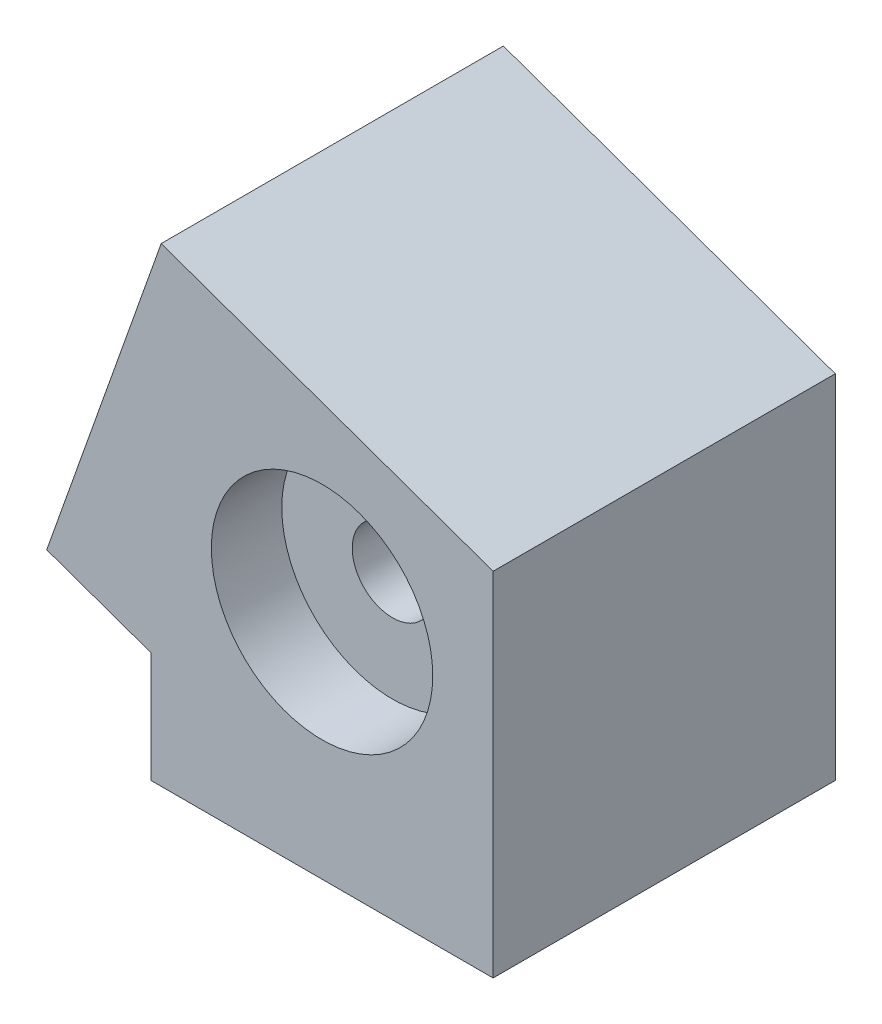
ISO-10303-21;
HEADER;
FILE_DESCRIPTION(('STEP AP214'),'2;1');
FILE_NAME('part.step','',(''),(''),'','','');
FILE_SCHEMA(('AUTOMOTIVE_DESIGN { 1 0 10303 214 1 1 1 1 }'));
ENDSEC;
DATA;
#1=APPLICATION_CONTEXT('core data for automotive mechanical design processes');
#2=APPLICATION_PROTOCOL_DEFINITION('international standard','automotive_design',2000,#1);
#3=PRODUCT_CONTEXT('',#1,'mechanical');
#4=PRODUCT('Part','Part','',(#3));
#5=PRODUCT_RELATED_PRODUCT_CATEGORY('part','',(#4));
#6=PRODUCT_DEFINITION_FORMATION('','',#4);
#7=PRODUCT_DEFINITION_CONTEXT('part definition',#1,'design');
#8=PRODUCT_DEFINITION('design','',#6,#7);
#9=PRODUCT_DEFINITION_SHAPE('','',#8);
#10=(LENGTH_UNIT() NAMED_UNIT(*) SI_UNIT(.MILLI.,.METRE.));
#11=(NAMED_UNIT(*) PLANE_ANGLE_UNIT() SI_UNIT($,.RADIAN.));
#12=(NAMED_UNIT(*) SI_UNIT($,.STERADIAN.) SOLID_ANGLE_UNIT());
#13=UNCERTAINTY_MEASURE_WITH_UNIT(LENGTH_MEASURE(1.E-05),#10,'distance_accuracy_value','');
#14=(GEOMETRIC_REPRESENTATION_CONTEXT(3) GLOBAL_UNCERTAINTY_ASSIGNED_CONTEXT((#13)) GLOBAL_UNIT_ASSIGNED_CONTEXT((#10,
#11,#12)) REPRESENTATION_CONTEXT('',''));
#15=CARTESIAN_POINT('',(0.,0.,0.));
#16=DIRECTION('',(0.,0.,1.));
#17=DIRECTION('',(1.,0.,0.));
#18=AXIS2_PLACEMENT_3D('',#15,#16,#17);
#19=CARTESIAN_POINT('',(-21.6706671951878,30.6896057397236,0.));
#20=DIRECTION('',(-0.942371237949982,0.33456905099638,0.));
#21=DIRECTION('',(0.,0.,-1.));
#22=AXIS2_PLACEMENT_3D('',#19,#20,#21);
#23=PLANE('',#22);
#24=DIRECTION('',(0.,0.,-1.));
#25=VECTOR('',#24,1.);
#26=CARTESIAN_POINT('',(-15.9829933282494,46.7099167848733,17.));
#27=LINE('',#26,#25);
#28=CARTESIAN_POINT('',(-15.9829933282494,46.7099167848733,17.));
#29=VERTEX_POINT('',#28);
#30=CARTESIAN_POINT('',(-15.9829933282494,46.7099167848733,-17.));
#31=VERTEX_POINT('',#30);
#32=EDGE_CURVE('E197',#29,#31,#27,.T.);
#33=ORIENTED_EDGE('',*,*,#32,.T.);
#34=DIRECTION('',(-0.334569050996379,-0.942371237949982,0.));
#35=VECTOR('',#34,1.);
#36=CARTESIAN_POINT('',(-27.3583410621263,14.6692946945739,-17.));
#37=LINE('',#36,#35);
#38=CARTESIAN_POINT('',(-27.3583410621263,14.6692946945739,-17.));
#39=VERTEX_POINT('',#38);
#40=EDGE_CURVE('E214',#31,#39,#37,.T.);
#41=ORIENTED_EDGE('',*,*,#40,.T.);
#42=DIRECTION('',(0.,0.,1.));
#43=VECTOR('',#42,1.);
#44=CARTESIAN_POINT('',(-27.3583410621263,14.6692946945739,17.));
#45=LINE('',#44,#43);
#46=CARTESIAN_POINT('',(-27.3583410621263,14.6692946945739,17.));
#47=VERTEX_POINT('',#46);
#48=EDGE_CURVE('E210',#39,#47,#45,.T.);
#49=ORIENTED_EDGE('',*,*,#48,.T.);
#50=DIRECTION('',(0.334569050996379,0.942371237949982,0.));
#51=VECTOR('',#50,1.);
#52=CARTESIAN_POINT('',(-27.3583410621263,14.6692946945739,17.));
#53=LINE('',#52,#51);
#54=EDGE_CURVE('E206',#47,#29,#53,.T.);
#55=ORIENTED_EDGE('',*,*,#54,.T.);
#56=EDGE_LOOP('',(#33,#41,#49,#55));
#57=FACE_BOUND('',#56,.T.);
#58=DIRECTION('',(0.334569050996379,0.942371237949982,0.));
#59=VECTOR('',#58,1.);
#60=CARTESIAN_POINT('',(-26.6892029601335,16.5540371704739,-15.));
#61=LINE('',#60,#59);
#62=CARTESIAN_POINT('',(-26.6892029601335,16.5540371704739,-15.));
#63=VERTEX_POINT('',#62);
#64=CARTESIAN_POINT('',(-16.6521314302421,44.8251743089733,-15.));
#65=VERTEX_POINT('',#64);
#66=EDGE_CURVE('E187',#63,#65,#61,.T.);
#67=ORIENTED_EDGE('',*,*,#66,.T.);
#68=DIRECTION('',(0.,0.,1.));
#69=VECTOR('',#68,1.);
#70=CARTESIAN_POINT('',(-16.6521314302422,44.8251743089733,-15.));
#71=LINE('',#70,#69);
#72=CARTESIAN_POINT('',(-16.6521314302422,44.8251743089733,15.));
#73=VERTEX_POINT('',#72);
#74=EDGE_CURVE('E62',#65,#73,#71,.T.);
#75=ORIENTED_EDGE('',*,*,#74,.T.);
#76=DIRECTION('',(-0.334569050996379,-0.942371237949982,0.));
#77=VECTOR('',#76,1.);
#78=CARTESIAN_POINT('',(-26.6892029601335,16.5540371704739,15.));
#79=LINE('',#78,#77);
#80=CARTESIAN_POINT('',(-26.6892029601335,16.5540371704739,15.));
#81=VERTEX_POINT('',#80);
#82=EDGE_CURVE('E171',#73,#81,#79,.T.);
#83=ORIENTED_EDGE('',*,*,#82,.T.);
#84=DIRECTION('',(0.,0.,-1.));
#85=VECTOR('',#84,1.);
#86=CARTESIAN_POINT('',(-26.6892029601335,16.5540371704739,-15.));
#87=LINE('',#86,#85);
#88=EDGE_CURVE('E175',#81,#63,#87,.T.);
#89=ORIENTED_EDGE('',*,*,#88,.T.);
#90=EDGE_LOOP('',(#67,#75,#83,#89));
#91=FACE_BOUND('',#90,.T.);
#92=ADVANCED_FACE('F45',(#57,#91),#23,.T.);
#93=CARTESIAN_POINT('',(17.,35.,17.));
#94=DIRECTION('',(-1.,0.,0.));
#95=DIRECTION('',(0.,0.,1.));
#96=AXIS2_PLACEMENT_3D('',#93,#94,#95);
#97=PLANE('',#96);
#98=DIRECTION('',(0.,0.,-1.));
#99=VECTOR('',#98,1.);
#100=CARTESIAN_POINT('',(17.,0.,17.));
#101=LINE('',#100,#99);
#102=CARTESIAN_POINT('',(17.,0.,17.));
#103=VERTEX_POINT('',#102);
#104=CARTESIAN_POINT('',(17.,0.,-17.));
#105=VERTEX_POINT('',#104);
#106=EDGE_CURVE('E274',#103,#105,#101,.T.);
#107=ORIENTED_EDGE('',*,*,#106,.T.);
#108=DIRECTION('',(0.,-1.,0.));
#109=VECTOR('',#108,1.);
#110=CARTESIAN_POINT('',(17.,35.,-17.));
#111=LINE('',#110,#109);
#112=CARTESIAN_POINT('',(17.,35.,-17.));
#113=VERTEX_POINT('',#112);
#114=EDGE_CURVE('E11',#113,#105,#111,.T.);
#115=ORIENTED_EDGE('',*,*,#114,.F.);
#116=DIRECTION('',(0.,0.,-1.));
#117=VECTOR('',#116,1.);
#118=CARTESIAN_POINT('',(17.,35.,17.));
#119=LINE('',#118,#117);
#120=CARTESIAN_POINT('',(17.,35.,17.));
#121=VERTEX_POINT('',#120);
#122=EDGE_CURVE('E275',#121,#113,#119,.T.);
#123=ORIENTED_EDGE('',*,*,#122,.F.);
#124=DIRECTION('',(0.,-1.,0.));
#125=VECTOR('',#124,1.);
#126=CARTESIAN_POINT('',(17.,35.,17.));
#127=LINE('',#126,#125);
#128=EDGE_CURVE('E279',#121,#103,#127,.T.);
#129=ORIENTED_EDGE('',*,*,#128,.T.);
#130=EDGE_LOOP('',(#107,#115,#123,#129));
#131=FACE_BOUND('',#130,.T.);
#132=ADVANCED_FACE('F47',(#131),#97,.F.);
#133=CARTESIAN_POINT('',(-17.,35.,-17.));
#134=DIRECTION('',(0.,0.,1.));
#135=DIRECTION('',(1.,0.,0.));
#136=AXIS2_PLACEMENT_3D('',#133,#134,#135);
#137=PLANE('',#136);
#138=CARTESIAN_POINT('',(0.,22.9958919823676,-17.));
#139=DIRECTION('',(0.,0.,-1.));
#140=DIRECTION('',(-1.,0.,0.));
#141=AXIS2_PLACEMENT_3D('',#138,#139,#140);
#142=CIRCLE('',#141,11.);
#143=CARTESIAN_POINT('',(-11.,22.9958919823676,-17.));
#144=VERTEX_POINT('',#143);
#145=EDGE_CURVE('E178',#144,#144,#142,.T.);
#146=ORIENTED_EDGE('',*,*,#145,.F.);
#147=EDGE_LOOP('',(#146));
#148=FACE_BOUND('',#147,.T.);
#149=DIRECTION('',(0.,-1.,0.));
#150=VECTOR('',#149,1.);
#151=CARTESIAN_POINT('',(-17.,35.,-17.));
#152=LINE('',#151,#150);
#153=CARTESIAN_POINT('',(-17.,10.9917839647352,-17.));
#154=VERTEX_POINT('',#153);
#155=CARTESIAN_POINT('',(-17.,0.,-17.));
#156=VERTEX_POINT('',#155);
#157=EDGE_CURVE('E55',#154,#156,#152,.T.);
#158=ORIENTED_EDGE('',*,*,#157,.F.);
#159=DIRECTION('',(-0.942371237949982,0.33456905099638,0.));
#160=VECTOR('',#159,1.);
#161=CARTESIAN_POINT('',(5.62465226612309,2.9593779097006,-17.));
#162=LINE('',#161,#160);
#163=EDGE_CURVE('E221',#154,#39,#162,.T.);
#164=ORIENTED_EDGE('',*,*,#163,.T.);
#165=ORIENTED_EDGE('',*,*,#40,.F.);
#166=DIRECTION('',(-0.942371237949982,0.33456905099638,0.));
#167=VECTOR('',#166,1.);
#168=CARTESIAN_POINT('',(17.,35.,-17.));
#169=LINE('',#168,#167);
#170=EDGE_CURVE('E218',#113,#31,#169,.T.);
#171=ORIENTED_EDGE('',*,*,#170,.F.);
#172=ORIENTED_EDGE('',*,*,#114,.T.);
#173=DIRECTION('',(-1.,0.,0.));
#174=VECTOR('',#173,1.);
#175=CARTESIAN_POINT('',(-17.,0.,-17.));
#176=LINE('',#175,#174);
#177=EDGE_CURVE('E284',#105,#156,#176,.T.);
#178=ORIENTED_EDGE('',*,*,#177,.T.);
#179=EDGE_LOOP('',(#158,#164,#165,#171,#172,#178));
#180=FACE_BOUND('',#179,.T.);
#181=ADVANCED_FACE('F308',(#148,#180),#137,.F.);
#182=CARTESIAN_POINT('',(-17.,35.,17.));
#183=DIRECTION('',(1.,0.,0.));
#184=DIRECTION('',(0.,0.,-1.));
#185=AXIS2_PLACEMENT_3D('',#182,#183,#184);
#186=PLANE('',#185);
#187=DIRECTION('',(0.,-1.,0.));
#188=VECTOR('',#187,1.);
#189=CARTESIAN_POINT('',(-17.,35.,17.));
#190=LINE('',#189,#188);
#191=CARTESIAN_POINT('',(-17.,10.9917839647352,17.));
#192=VERTEX_POINT('',#191);
#193=CARTESIAN_POINT('',(-17.,0.,17.));
#194=VERTEX_POINT('',#193);
#195=EDGE_CURVE('E297',#192,#194,#190,.T.);
#196=ORIENTED_EDGE('',*,*,#195,.F.);
#197=DIRECTION('',(0.,0.,1.));
#198=VECTOR('',#197,1.);
#199=CARTESIAN_POINT('',(-17.,10.9917839647352,-18.));
#200=LINE('',#199,#198);
#201=EDGE_CURVE('E262',#154,#192,#200,.T.);
#202=ORIENTED_EDGE('',*,*,#201,.F.);
#203=ORIENTED_EDGE('',*,*,#157,.T.);
#204=DIRECTION('',(0.,0.,1.));
#205=VECTOR('',#204,1.);
#206=CARTESIAN_POINT('',(-17.,0.,17.));
#207=LINE('',#206,#205);
#208=EDGE_CURVE('E288',#156,#194,#207,.T.);
#209=ORIENTED_EDGE('',*,*,#208,.T.);
#210=EDGE_LOOP('',(#196,#202,#203,#209));
#211=FACE_BOUND('',#210,.T.);
#212=ADVANCED_FACE('F303',(#211),#186,.F.);
#213=CARTESIAN_POINT('',(-17.,35.,17.));
#214=DIRECTION('',(0.,0.,-1.));
#215=DIRECTION('',(-1.,0.,0.));
#216=AXIS2_PLACEMENT_3D('',#213,#214,#215);
#217=PLANE('',#216);
#218=CARTESIAN_POINT('',(0.,22.9958919823676,17.));
#219=DIRECTION('',(0.,0.,1.));
#220=DIRECTION('',(1.,0.,0.));
#221=AXIS2_PLACEMENT_3D('',#218,#219,#220);
#222=CIRCLE('',#221,11.);
#223=CARTESIAN_POINT('',(11.,22.9958919823676,17.));
#224=VERTEX_POINT('',#223);
#225=EDGE_CURVE('E392',#224,#224,#222,.T.);
#226=ORIENTED_EDGE('',*,*,#225,.F.);
#227=EDGE_LOOP('',(#226));
#228=FACE_BOUND('',#227,.T.);
#229=DIRECTION('',(-0.942371237949982,0.33456905099638,0.));
#230=VECTOR('',#229,1.);
#231=CARTESIAN_POINT('',(5.62465226612309,2.9593779097006,17.));
#232=LINE('',#231,#230);
#233=EDGE_CURVE('E224',#192,#47,#232,.T.);
#234=ORIENTED_EDGE('',*,*,#233,.F.);
#235=ORIENTED_EDGE('',*,*,#195,.T.);
#236=DIRECTION('',(1.,0.,0.));
#237=VECTOR('',#236,1.);
#238=CARTESIAN_POINT('',(-17.,0.,17.));
#239=LINE('',#238,#237);
#240=EDGE_CURVE('E280',#194,#103,#239,.T.);
#241=ORIENTED_EDGE('',*,*,#240,.T.);
#242=ORIENTED_EDGE('',*,*,#128,.F.);
#243=DIRECTION('',(-0.942371237949982,0.33456905099638,0.));
#244=VECTOR('',#243,1.);
#245=CARTESIAN_POINT('',(17.,35.,17.));
#246=LINE('',#245,#244);
#247=EDGE_CURVE('E227',#121,#29,#246,.T.);
#248=ORIENTED_EDGE('',*,*,#247,.T.);
#249=ORIENTED_EDGE('',*,*,#54,.F.);
#250=EDGE_LOOP('',(#234,#235,#241,#242,#248,#249));
#251=FACE_BOUND('',#250,.T.);
#252=ADVANCED_FACE('F315',(#228,#251),#217,.F.);
#253=CARTESIAN_POINT('',(0.,0.,0.));
#254=DIRECTION('',(0.,-1.,0.));
#255=DIRECTION('',(0.,0.,-1.));
#256=AXIS2_PLACEMENT_3D('',#253,#254,#255);
#257=PLANE('',#256);
#258=DIRECTION('',(0.,0.,1.));
#259=VECTOR('',#258,1.);
#260=CARTESIAN_POINT('',(15.,0.,-15.));
#261=LINE('',#260,#259);
#262=CARTESIAN_POINT('',(15.,0.,-15.));
#263=VERTEX_POINT('',#262);
#264=CARTESIAN_POINT('',(15.,0.,15.));
#265=VERTEX_POINT('',#264);
#266=EDGE_CURVE('E70',#263,#265,#261,.T.);
#267=ORIENTED_EDGE('',*,*,#266,.F.);
#268=DIRECTION('',(1.,0.,0.));
#269=VECTOR('',#268,1.);
#270=CARTESIAN_POINT('',(-15.,0.,-15.));
#271=LINE('',#270,#269);
#272=CARTESIAN_POINT('',(-15.,0.,-15.));
#273=VERTEX_POINT('',#272);
#274=EDGE_CURVE('E235',#273,#263,#271,.T.);
#275=ORIENTED_EDGE('',*,*,#274,.F.);
#276=DIRECTION('',(0.,0.,-1.));
#277=VECTOR('',#276,1.);
#278=CARTESIAN_POINT('',(-15.,0.,-15.));
#279=LINE('',#278,#277);
#280=CARTESIAN_POINT('',(-15.,0.,15.));
#281=VERTEX_POINT('',#280);
#282=EDGE_CURVE('E252',#281,#273,#279,.T.);
#283=ORIENTED_EDGE('',*,*,#282,.F.);
#284=DIRECTION('',(-1.,0.,0.));
#285=VECTOR('',#284,1.);
#286=CARTESIAN_POINT('',(-15.,0.,15.));
#287=LINE('',#286,#285);
#288=EDGE_CURVE('E248',#265,#281,#287,.T.);
#289=ORIENTED_EDGE('',*,*,#288,.F.);
#290=EDGE_LOOP('',(#267,#275,#283,#289));
#291=FACE_BOUND('',#290,.T.);
#292=ORIENTED_EDGE('',*,*,#106,.F.);
#293=ORIENTED_EDGE('',*,*,#240,.F.);
#294=ORIENTED_EDGE('',*,*,#208,.F.);
#295=ORIENTED_EDGE('',*,*,#177,.F.);
#296=EDGE_LOOP('',(#292,#293,#294,#295));
#297=FACE_BOUND('',#296,.T.);
#298=ADVANCED_FACE('F312',(#291,#297),#257,.T.);
#299=CARTESIAN_POINT('',(15.,10.,-15.));
#300=DIRECTION('',(1.,0.,0.));
#301=DIRECTION('',(0.,0.,-1.));
#302=AXIS2_PLACEMENT_3D('',#299,#300,#301);
#303=PLANE('',#302);
#304=ORIENTED_EDGE('',*,*,#266,.T.);
#305=DIRECTION('',(0.,-1.,0.));
#306=VECTOR('',#305,1.);
#307=CARTESIAN_POINT('',(15.,10.,15.));
#308=LINE('',#307,#306);
#309=CARTESIAN_POINT('',(15.,10.,15.));
#310=VERTEX_POINT('',#309);
#311=EDGE_CURVE('E245',#310,#265,#308,.T.);
#312=ORIENTED_EDGE('',*,*,#311,.F.);
#313=DIRECTION('',(0.,0.,1.));
#314=VECTOR('',#313,1.);
#315=CARTESIAN_POINT('',(15.,10.,-15.));
#316=LINE('',#315,#314);
#317=CARTESIAN_POINT('',(15.,10.,-15.));
#318=VERTEX_POINT('',#317);
#319=EDGE_CURVE('E230',#318,#310,#316,.T.);
#320=ORIENTED_EDGE('',*,*,#319,.F.);
#321=DIRECTION('',(0.,-1.,0.));
#322=VECTOR('',#321,1.);
#323=CARTESIAN_POINT('',(15.,10.,-15.));
#324=LINE('',#323,#322);
#325=EDGE_CURVE('E259',#318,#263,#324,.T.);
#326=ORIENTED_EDGE('',*,*,#325,.T.);
#327=EDGE_LOOP('',(#304,#312,#320,#326));
#328=FACE_BOUND('',#327,.T.);
#329=ADVANCED_FACE('F419',(#328),#303,.F.);
#330=CARTESIAN_POINT('',(-15.,10.,-15.));
#331=DIRECTION('',(0.,0.,-1.));
#332=DIRECTION('',(-1.,0.,0.));
#333=AXIS2_PLACEMENT_3D('',#330,#331,#332);
#334=PLANE('',#333);
#335=ORIENTED_EDGE('',*,*,#325,.F.);
#336=DIRECTION('',(1.,0.,0.));
#337=VECTOR('',#336,1.);
#338=CARTESIAN_POINT('',(-15.,10.,-15.));
#339=LINE('',#338,#337);
#340=CARTESIAN_POINT('',(-15.,10.,-15.));
#341=VERTEX_POINT('',#340);
#342=EDGE_CURVE('E242',#341,#318,#339,.T.);
#343=ORIENTED_EDGE('',*,*,#342,.F.);
#344=DIRECTION('',(0.,-1.,0.));
#345=VECTOR('',#344,1.);
#346=CARTESIAN_POINT('',(-15.,10.,-15.));
#347=LINE('',#346,#345);
#348=EDGE_CURVE('E263',#341,#273,#347,.T.);
#349=ORIENTED_EDGE('',*,*,#348,.T.);
#350=ORIENTED_EDGE('',*,*,#274,.T.);
#351=EDGE_LOOP('',(#335,#343,#349,#350));
#352=FACE_BOUND('',#351,.T.);
#353=ADVANCED_FACE('F423',(#352),#334,.F.);
#354=CARTESIAN_POINT('',(-15.,10.,-15.));
#355=DIRECTION('',(-1.,0.,0.));
#356=DIRECTION('',(0.,0.,1.));
#357=AXIS2_PLACEMENT_3D('',#354,#355,#356);
#358=PLANE('',#357);
#359=ORIENTED_EDGE('',*,*,#282,.T.);
#360=ORIENTED_EDGE('',*,*,#348,.F.);
#361=DIRECTION('',(0.,0.,-1.));
#362=VECTOR('',#361,1.);
#363=CARTESIAN_POINT('',(-15.,10.,-15.));
#364=LINE('',#363,#362);
#365=CARTESIAN_POINT('',(-15.,10.,15.));
#366=VERTEX_POINT('',#365);
#367=EDGE_CURVE('E238',#366,#341,#364,.T.);
#368=ORIENTED_EDGE('',*,*,#367,.F.);
#369=DIRECTION('',(0.,-1.,0.));
#370=VECTOR('',#369,1.);
#371=CARTESIAN_POINT('',(-15.,10.,15.));
#372=LINE('',#371,#370);
#373=EDGE_CURVE('E266',#366,#281,#372,.T.);
#374=ORIENTED_EDGE('',*,*,#373,.T.);
#375=EDGE_LOOP('',(#359,#360,#368,#374));
#376=FACE_BOUND('',#375,.T.);
#377=ADVANCED_FACE('F426',(#376),#358,.F.);
#378=CARTESIAN_POINT('',(-15.,10.,15.));
#379=DIRECTION('',(0.,0.,1.));
#380=DIRECTION('',(1.,0.,0.));
#381=AXIS2_PLACEMENT_3D('',#378,#379,#380);
#382=PLANE('',#381);
#383=ORIENTED_EDGE('',*,*,#373,.F.);
#384=DIRECTION('',(-1.,0.,0.));
#385=VECTOR('',#384,1.);
#386=CARTESIAN_POINT('',(-15.,10.,15.));
#387=LINE('',#386,#385);
#388=EDGE_CURVE('E234',#310,#366,#387,.T.);
#389=ORIENTED_EDGE('',*,*,#388,.F.);
#390=ORIENTED_EDGE('',*,*,#311,.T.);
#391=ORIENTED_EDGE('',*,*,#288,.T.);
#392=EDGE_LOOP('',(#383,#389,#390,#391));
#393=FACE_BOUND('',#392,.T.);
#394=ADVANCED_FACE('F338',(#393),#382,.F.);
#395=CARTESIAN_POINT('',(0.,10.,0.));
#396=DIRECTION('',(0.,1.,0.));
#397=DIRECTION('',(0.,0.,1.));
#398=AXIS2_PLACEMENT_3D('',#395,#396,#397);
#399=PLANE('',#398);
#400=ORIENTED_EDGE('',*,*,#342,.T.);
#401=ORIENTED_EDGE('',*,*,#319,.T.);
#402=ORIENTED_EDGE('',*,*,#388,.T.);
#403=ORIENTED_EDGE('',*,*,#367,.T.);
#404=EDGE_LOOP('',(#400,#401,#402,#403));
#405=FACE_BOUND('',#404,.T.);
#406=ADVANCED_FACE('F330',(#405),#399,.F.);
#407=CARTESIAN_POINT('',(5.62465226612309,2.9593779097006,17.));
#408=DIRECTION('',(-0.33456905099638,-0.942371237949982,0.));
#409=DIRECTION('',(0.942371237949982,-0.33456905099638,0.));
#410=AXIS2_PLACEMENT_3D('',#407,#408,#409);
#411=PLANE('',#410);
#412=ORIENTED_EDGE('',*,*,#201,.T.);
#413=ORIENTED_EDGE('',*,*,#233,.T.);
#414=ORIENTED_EDGE('',*,*,#48,.F.);
#415=ORIENTED_EDGE('',*,*,#163,.F.);
#416=EDGE_LOOP('',(#412,#413,#414,#415));
#417=FACE_BOUND('',#416,.T.);
#418=ADVANCED_FACE('F328',(#417),#411,.T.);
#419=CARTESIAN_POINT('',(17.,35.,17.));
#420=DIRECTION('',(0.33456905099638,0.942371237949982,0.));
#421=DIRECTION('',(-0.942371237949982,0.33456905099638,0.));
#422=AXIS2_PLACEMENT_3D('',#419,#420,#421);
#423=PLANE('',#422);
#424=ORIENTED_EDGE('',*,*,#32,.F.);
#425=ORIENTED_EDGE('',*,*,#247,.F.);
#426=ORIENTED_EDGE('',*,*,#122,.T.);
#427=ORIENTED_EDGE('',*,*,#170,.T.);
#428=EDGE_LOOP('',(#424,#425,#426,#427));
#429=FACE_BOUND('',#428,.T.);
#430=ADVANCED_FACE('F321',(#429),#423,.T.);
#431=CARTESIAN_POINT('',(-7.22841905074233,41.4794837990095,-15.));
#432=DIRECTION('',(-0.33456905099638,-0.942371237949982,0.));
#433=DIRECTION('',(0.942371237949982,-0.33456905099638,0.));
#434=AXIS2_PLACEMENT_3D('',#431,#432,#433);
#435=PLANE('',#434);
#436=ORIENTED_EDGE('',*,*,#74,.F.);
#437=DIRECTION('',(-0.942371237949982,0.33456905099638,0.));
#438=VECTOR('',#437,1.);
#439=CARTESIAN_POINT('',(-7.22841905074233,41.4794837990095,-15.));
#440=LINE('',#439,#438);
#441=CARTESIAN_POINT('',(-7.22841905074233,41.4794837990095,-15.));
#442=VERTEX_POINT('',#441);
#443=EDGE_CURVE('E153',#442,#65,#440,.T.);
#444=ORIENTED_EDGE('',*,*,#443,.F.);
#445=DIRECTION('',(0.,0.,1.));
#446=VECTOR('',#445,1.);
#447=CARTESIAN_POINT('',(-7.22841905074233,41.4794837990095,-15.));
#448=LINE('',#447,#446);
#449=CARTESIAN_POINT('',(-7.22841905074233,41.4794837990095,15.));
#450=VERTEX_POINT('',#449);
#451=EDGE_CURVE('E161',#442,#450,#448,.T.);
#452=ORIENTED_EDGE('',*,*,#451,.T.);
#453=DIRECTION('',(-0.942371237949982,0.33456905099638,0.));
#454=VECTOR('',#453,1.);
#455=CARTESIAN_POINT('',(-7.22841905074233,41.4794837990095,15.));
#456=LINE('',#455,#454);
#457=EDGE_CURVE('E194',#450,#73,#456,.T.);
#458=ORIENTED_EDGE('',*,*,#457,.T.);
#459=EDGE_LOOP('',(#436,#444,#452,#458));
#460=FACE_BOUND('',#459,.T.);
#461=ADVANCED_FACE('F164',(#460),#435,.T.);
#462=CARTESIAN_POINT('',(-17.2654905806337,13.2083466605101,15.));
#463=DIRECTION('',(0.,0.,-1.));
#464=DIRECTION('',(-1.,0.,0.));
#465=AXIS2_PLACEMENT_3D('',#462,#463,#464);
#466=PLANE('',#465);
#467=ORIENTED_EDGE('',*,*,#82,.F.);
#468=ORIENTED_EDGE('',*,*,#457,.F.);
#469=DIRECTION('',(-0.334569050996379,-0.942371237949982,0.));
#470=VECTOR('',#469,1.);
#471=CARTESIAN_POINT('',(-17.2654905806337,13.2083466605101,15.));
#472=LINE('',#471,#470);
#473=CARTESIAN_POINT('',(-17.2654905806337,13.2083466605101,15.));
#474=VERTEX_POINT('',#473);
#475=EDGE_CURVE('E167',#450,#474,#472,.T.);
#476=ORIENTED_EDGE('',*,*,#475,.T.);
#477=DIRECTION('',(-0.942371237949982,0.33456905099638,0.));
#478=VECTOR('',#477,1.);
#479=CARTESIAN_POINT('',(-17.2654905806337,13.2083466605101,15.));
#480=LINE('',#479,#478);
#481=EDGE_CURVE('E198',#474,#81,#480,.T.);
#482=ORIENTED_EDGE('',*,*,#481,.T.);
#483=EDGE_LOOP('',(#467,#468,#476,#482));
#484=FACE_BOUND('',#483,.T.);
#485=ADVANCED_FACE('F350',(#484),#466,.T.);
#486=CARTESIAN_POINT('',(-17.2654905806337,13.2083466605101,-15.));
#487=DIRECTION('',(0.33456905099638,0.942371237949982,0.));
#488=DIRECTION('',(-0.942371237949982,0.33456905099638,0.));
#489=AXIS2_PLACEMENT_3D('',#486,#487,#488);
#490=PLANE('',#489);
#491=ORIENTED_EDGE('',*,*,#88,.F.);
#492=ORIENTED_EDGE('',*,*,#481,.F.);
#493=DIRECTION('',(0.,0.,-1.));
#494=VECTOR('',#493,1.);
#495=CARTESIAN_POINT('',(-17.2654905806337,13.2083466605101,-15.));
#496=LINE('',#495,#494);
#497=CARTESIAN_POINT('',(-17.2654905806337,13.2083466605101,-15.));
#498=VERTEX_POINT('',#497);
#499=EDGE_CURVE('E160',#474,#498,#496,.T.);
#500=ORIENTED_EDGE('',*,*,#499,.T.);
#501=DIRECTION('',(-0.942371237949982,0.33456905099638,0.));
#502=VECTOR('',#501,1.);
#503=CARTESIAN_POINT('',(-17.2654905806337,13.2083466605101,-15.));
#504=LINE('',#503,#502);
#505=EDGE_CURVE('E155',#498,#63,#504,.T.);
#506=ORIENTED_EDGE('',*,*,#505,.T.);
#507=EDGE_LOOP('',(#491,#492,#500,#506));
#508=FACE_BOUND('',#507,.T.);
#509=ADVANCED_FACE('F353',(#508),#490,.T.);
#510=CARTESIAN_POINT('',(-17.2654905806337,13.2083466605101,-15.));
#511=DIRECTION('',(0.,0.,1.));
#512=DIRECTION('',(1.,0.,0.));
#513=AXIS2_PLACEMENT_3D('',#510,#511,#512);
#514=PLANE('',#513);
#515=ORIENTED_EDGE('',*,*,#66,.F.);
#516=ORIENTED_EDGE('',*,*,#505,.F.);
#517=DIRECTION('',(0.334569050996379,0.942371237949982,0.));
#518=VECTOR('',#517,1.);
#519=CARTESIAN_POINT('',(-17.2654905806337,13.2083466605101,-15.));
#520=LINE('',#519,#518);
#521=EDGE_CURVE('E150',#498,#442,#520,.T.);
#522=ORIENTED_EDGE('',*,*,#521,.T.);
#523=ORIENTED_EDGE('',*,*,#443,.T.);
#524=EDGE_LOOP('',(#515,#516,#522,#523));
#525=FACE_BOUND('',#524,.T.);
#526=ADVANCED_FACE('F152',(#525),#514,.T.);
#527=CARTESIAN_POINT('',(-12.246954815688,27.3439152297598,0.));
#528=DIRECTION('',(0.942371237949982,-0.33456905099638,0.));
#529=DIRECTION('',(0.,0.,1.));
#530=AXIS2_PLACEMENT_3D('',#527,#528,#529);
#531=PLANE('',#530);
#532=ORIENTED_EDGE('',*,*,#451,.F.);
#533=ORIENTED_EDGE('',*,*,#521,.F.);
#534=ORIENTED_EDGE('',*,*,#499,.F.);
#535=ORIENTED_EDGE('',*,*,#475,.F.);
#536=EDGE_LOOP('',(#532,#533,#534,#535));
#537=FACE_BOUND('',#536,.T.);
#538=ADVANCED_FACE('F169',(#537),#531,.F.);
#539=CARTESIAN_POINT('',(0.,22.9958919823676,-9.99999999999999));
#540=DIRECTION('',(0.,0.,-1.));
#541=DIRECTION('',(-1.,0.,0.));
#542=AXIS2_PLACEMENT_3D('',#539,#540,#541);
#543=CYLINDRICAL_SURFACE('',#542,11.);
#544=CARTESIAN_POINT('',(0.,22.9958919823676,-9.99999999999999));
#545=DIRECTION('',(0.,0.,-1.));
#546=DIRECTION('',(-1.,0.,0.));
#547=AXIS2_PLACEMENT_3D('',#544,#545,#546);
#548=CIRCLE('',#547,11.);
#549=CARTESIAN_POINT('',(-11.,22.9958919823676,-9.99999999999999));
#550=VERTEX_POINT('',#549);
#551=EDGE_CURVE('E188',#550,#550,#548,.T.);
#552=ORIENTED_EDGE('',*,*,#551,.F.);
#553=EDGE_LOOP('',(#552));
#554=FACE_BOUND('',#553,.T.);
#555=ORIENTED_EDGE('',*,*,#145,.T.);
#556=EDGE_LOOP('',(#555));
#557=FACE_BOUND('',#556,.T.);
#558=ADVANCED_FACE('F362',(#554,#557),#543,.F.);
#559=CARTESIAN_POINT('',(0.,22.9958919823676,-9.99999999999999));
#560=DIRECTION('',(0.,0.,-1.));
#561=DIRECTION('',(-1.,0.,0.));
#562=AXIS2_PLACEMENT_3D('',#559,#560,#561);
#563=PLANE('',#562);
#564=CARTESIAN_POINT('',(0.,22.9958919823676,-9.99999999999999));
#565=DIRECTION('',(0.,0.,-1.));
#566=DIRECTION('',(-1.,0.,0.));
#567=AXIS2_PLACEMENT_3D('',#564,#565,#566);
#568=CIRCLE('',#567,4.);
#569=CARTESIAN_POINT('',(-4.00000000000001,22.9958919823676,-9.99999999999999));
#570=VERTEX_POINT('',#569);
#571=EDGE_CURVE('E49',#570,#570,#568,.T.);
#572=ORIENTED_EDGE('',*,*,#571,.F.);
#573=EDGE_LOOP('',(#572));
#574=FACE_BOUND('',#573,.T.);
#575=ORIENTED_EDGE('',*,*,#551,.T.);
#576=EDGE_LOOP('',(#575));
#577=FACE_BOUND('',#576,.T.);
#578=ADVANCED_FACE('F365',(#574,#577),#563,.T.);
#579=CARTESIAN_POINT('',(0.,22.9958919823676,10.));
#580=DIRECTION('',(0.,0.,1.));
#581=DIRECTION('',(1.,0.,0.));
#582=AXIS2_PLACEMENT_3D('',#579,#580,#581);
#583=CYLINDRICAL_SURFACE('',#582,11.);
#584=CARTESIAN_POINT('',(0.,22.9958919823676,10.));
#585=DIRECTION('',(0.,0.,1.));
#586=DIRECTION('',(1.,0.,0.));
#587=AXIS2_PLACEMENT_3D('',#584,#585,#586);
#588=CIRCLE('',#587,11.);
#589=CARTESIAN_POINT('',(11.,22.9958919823676,10.));
#590=VERTEX_POINT('',#589);
#591=EDGE_CURVE('E394',#590,#590,#588,.T.);
#592=ORIENTED_EDGE('',*,*,#591,.F.);
#593=EDGE_LOOP('',(#592));
#594=FACE_BOUND('',#593,.T.);
#595=ORIENTED_EDGE('',*,*,#225,.T.);
#596=EDGE_LOOP('',(#595));
#597=FACE_BOUND('',#596,.T.);
#598=ADVANCED_FACE('F369',(#594,#597),#583,.F.);
#599=CARTESIAN_POINT('',(0.,22.9958919823676,10.));
#600=DIRECTION('',(0.,0.,1.));
#601=DIRECTION('',(1.,0.,0.));
#602=AXIS2_PLACEMENT_3D('',#599,#600,#601);
#603=PLANE('',#602);
#604=CARTESIAN_POINT('',(0.,22.9958919823676,10.));
#605=DIRECTION('',(0.,0.,1.));
#606=DIRECTION('',(1.,0.,0.));
#607=AXIS2_PLACEMENT_3D('',#604,#605,#606);
#608=CIRCLE('',#607,4.);
#609=CARTESIAN_POINT('',(3.99999999999999,22.9958919823676,10.));
#610=VERTEX_POINT('',#609);
#611=EDGE_CURVE('E388',#610,#610,#608,.T.);
#612=ORIENTED_EDGE('',*,*,#611,.F.);
#613=EDGE_LOOP('',(#612));
#614=FACE_BOUND('',#613,.T.);
#615=ORIENTED_EDGE('',*,*,#591,.T.);
#616=EDGE_LOOP('',(#615));
#617=FACE_BOUND('',#616,.T.);
#618=ADVANCED_FACE('F373',(#614,#617),#603,.T.);
#619=CARTESIAN_POINT('',(0.,22.9958919823676,-20.));
#620=DIRECTION('',(0.,0.,1.));
#621=DIRECTION('',(1.,0.,0.));
#622=AXIS2_PLACEMENT_3D('',#619,#620,#621);
#623=CYLINDRICAL_SURFACE('',#622,4.);
#624=ORIENTED_EDGE('',*,*,#571,.T.);
#625=EDGE_LOOP('',(#624));
#626=FACE_BOUND('',#625,.T.);
#627=ORIENTED_EDGE('',*,*,#611,.T.);
#628=EDGE_LOOP('',(#627));
#629=FACE_BOUND('',#628,.T.);
#630=ADVANCED_FACE('F377',(#626,#629),#623,.F.);
#631=CLOSED_SHELL('',(#92,#132,#181,#212,#252,#298,#329,#353,#377,#394,#406,#418,#430,#461,#485,
#509,#526,#538,#558,#578,#598,#618,#630));
#632=MANIFOLD_SOLID_BREP('B2',#631);
#633=ADVANCED_BREP_SHAPE_REPRESENTATION('',(#18,#632),#14);
#634=SHAPE_DEFINITION_REPRESENTATION(#9,#633);
ENDSEC;
END-ISO-10303-21;
